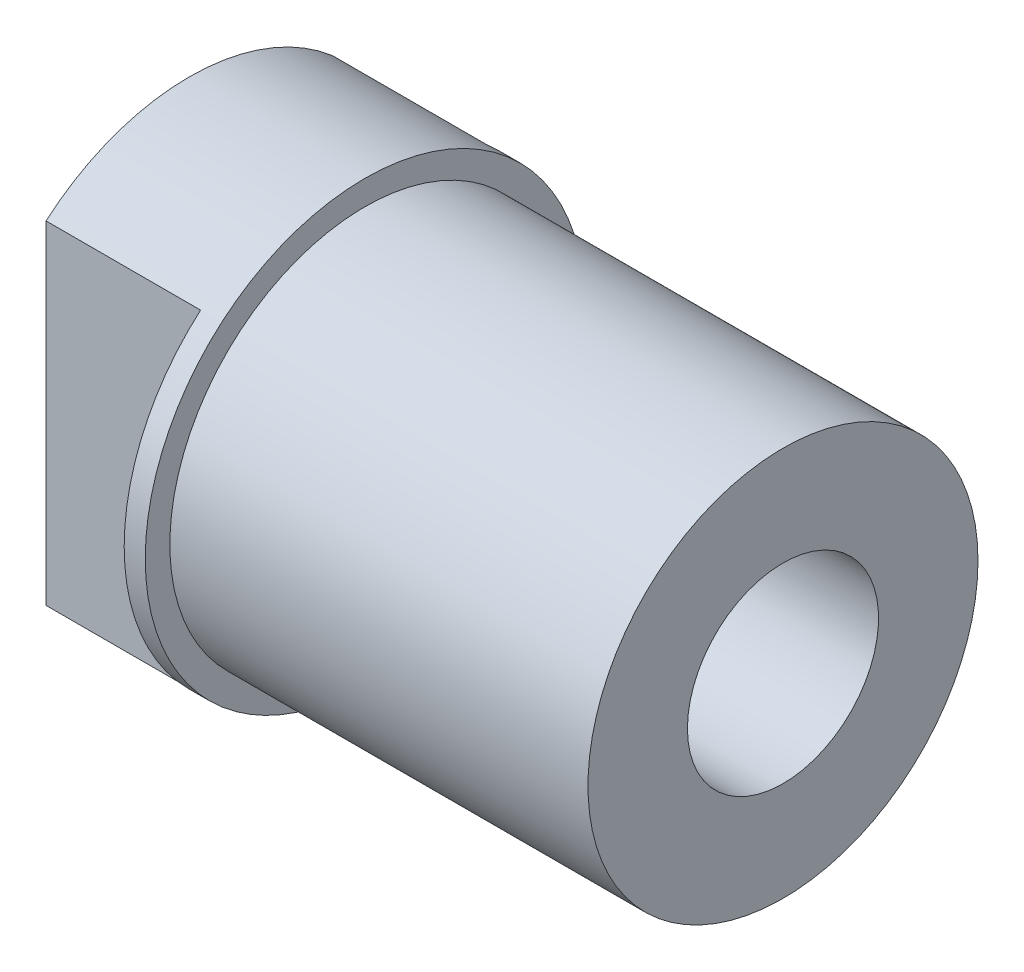
ISO-10303-21;
HEADER;
FILE_DESCRIPTION(('STEP AP214'),'2;1');
FILE_NAME('part.step','',(''),(''),'','','');
FILE_SCHEMA(('AUTOMOTIVE_DESIGN { 1 0 10303 214 1 1 1 1 }'));
ENDSEC;
DATA;
#1=APPLICATION_CONTEXT('core data for automotive mechanical design processes');
#2=APPLICATION_PROTOCOL_DEFINITION('international standard','automotive_design',2000,#1);
#3=PRODUCT_CONTEXT('',#1,'mechanical');
#4=PRODUCT('Part','Part','',(#3));
#5=PRODUCT_RELATED_PRODUCT_CATEGORY('part','',(#4));
#6=PRODUCT_DEFINITION_FORMATION('','',#4);
#7=PRODUCT_DEFINITION_CONTEXT('part definition',#1,'design');
#8=PRODUCT_DEFINITION('design','',#6,#7);
#9=PRODUCT_DEFINITION_SHAPE('','',#8);
#10=(LENGTH_UNIT() NAMED_UNIT(*) SI_UNIT(.MILLI.,.METRE.));
#11=(NAMED_UNIT(*) PLANE_ANGLE_UNIT() SI_UNIT($,.RADIAN.));
#12=(NAMED_UNIT(*) SI_UNIT($,.STERADIAN.) SOLID_ANGLE_UNIT());
#13=UNCERTAINTY_MEASURE_WITH_UNIT(LENGTH_MEASURE(1.E-05),#10,'distance_accuracy_value','');
#14=(GEOMETRIC_REPRESENTATION_CONTEXT(3) GLOBAL_UNCERTAINTY_ASSIGNED_CONTEXT((#13)) GLOBAL_UNIT_ASSIGNED_CONTEXT((#10,
#11,#12)) REPRESENTATION_CONTEXT('',''));
#15=CARTESIAN_POINT('',(0.,0.,0.));
#16=DIRECTION('',(0.,0.,1.));
#17=DIRECTION('',(1.,0.,0.));
#18=AXIS2_PLACEMENT_3D('',#15,#16,#17);
#19=CARTESIAN_POINT('',(-6.35,0.,0.));
#20=DIRECTION('',(1.,0.,0.));
#21=DIRECTION('',(0.,0.,-1.));
#22=AXIS2_PLACEMENT_3D('',#19,#20,#21);
#23=CYLINDRICAL_SURFACE('',#22,7.9375);
#24=DIRECTION('',(1.,0.,0.));
#25=VECTOR('',#24,1.);
#26=CARTESIAN_POINT('',(-6.35,-6.01836304052024,-5.17525));
#27=LINE('',#26,#25);
#28=CARTESIAN_POINT('',(-0.762,-6.01836304052024,-5.17525));
#29=VERTEX_POINT('',#28);
#30=CARTESIAN_POINT('',(-6.35,-6.01836304052024,-5.17525));
#31=VERTEX_POINT('',#30);
#32=EDGE_CURVE('E52',#29,#31,#27,.F.);
#33=ORIENTED_EDGE('',*,*,#32,.F.);
#34=CARTESIAN_POINT('',(-0.762,0.,0.));
#35=DIRECTION('',(1.,0.,0.));
#36=DIRECTION('',(0.,0.,-1.));
#37=AXIS2_PLACEMENT_3D('',#34,#35,#36);
#38=CIRCLE('',#37,7.9375);
#39=CARTESIAN_POINT('',(-0.762,6.01836304052024,-5.17525));
#40=VERTEX_POINT('',#39);
#41=EDGE_CURVE('E11',#40,#29,#38,.F.);
#42=ORIENTED_EDGE('',*,*,#41,.F.);
#43=DIRECTION('',(1.,0.,0.));
#44=VECTOR('',#43,1.);
#45=CARTESIAN_POINT('',(-6.35,6.01836304052024,-5.17525));
#46=LINE('',#45,#44);
#47=CARTESIAN_POINT('',(-6.35,6.01836304052024,-5.17525));
#48=VERTEX_POINT('',#47);
#49=EDGE_CURVE('E102',#48,#40,#46,.T.);
#50=ORIENTED_EDGE('',*,*,#49,.F.);
#51=CARTESIAN_POINT('',(-6.35,0.,0.));
#52=DIRECTION('',(1.,0.,0.));
#53=DIRECTION('',(0.,0.,-1.));
#54=AXIS2_PLACEMENT_3D('',#51,#52,#53);
#55=CIRCLE('',#54,7.9375);
#56=CARTESIAN_POINT('',(-6.35,6.01836304052024,5.17525));
#57=VERTEX_POINT('',#56);
#58=EDGE_CURVE('E112',#48,#57,#55,.T.);
#59=ORIENTED_EDGE('',*,*,#58,.T.);
#60=DIRECTION('',(1.,0.,0.));
#61=VECTOR('',#60,1.);
#62=CARTESIAN_POINT('',(-6.35,6.01836304052024,5.17525));
#63=LINE('',#62,#61);
#64=CARTESIAN_POINT('',(-0.762,6.01836304052024,5.17525));
#65=VERTEX_POINT('',#64);
#66=EDGE_CURVE('E60',#65,#57,#63,.F.);
#67=ORIENTED_EDGE('',*,*,#66,.F.);
#68=CARTESIAN_POINT('',(-0.762,0.,0.));
#69=DIRECTION('',(1.,0.,0.));
#70=DIRECTION('',(0.,0.,-1.));
#71=AXIS2_PLACEMENT_3D('',#68,#69,#70);
#72=CIRCLE('',#71,7.9375);
#73=CARTESIAN_POINT('',(-0.762,-6.01836304052024,5.17525));
#74=VERTEX_POINT('',#73);
#75=EDGE_CURVE('E45',#74,#65,#72,.F.);
#76=ORIENTED_EDGE('',*,*,#75,.F.);
#77=DIRECTION('',(1.,0.,0.));
#78=VECTOR('',#77,1.);
#79=CARTESIAN_POINT('',(-6.35,-6.01836304052024,5.17525));
#80=LINE('',#79,#78);
#81=CARTESIAN_POINT('',(-6.35,-6.01836304052024,5.17525));
#82=VERTEX_POINT('',#81);
#83=EDGE_CURVE('E81',#82,#74,#80,.T.);
#84=ORIENTED_EDGE('',*,*,#83,.F.);
#85=EDGE_CURVE('E113',#82,#31,#55,.T.);
#86=ORIENTED_EDGE('',*,*,#85,.T.);
#87=EDGE_LOOP('',(#33,#42,#50,#59,#67,#76,#84,#86));
#88=FACE_BOUND('',#87,.T.);
#89=CARTESIAN_POINT('',(0.,0.,0.));
#90=DIRECTION('',(1.,0.,0.));
#91=DIRECTION('',(0.,0.,-1.));
#92=AXIS2_PLACEMENT_3D('',#89,#90,#91);
#93=CIRCLE('',#92,7.9375);
#94=CARTESIAN_POINT('',(0.,0.,-7.9375));
#95=VERTEX_POINT('',#94);
#96=EDGE_CURVE('E108',#95,#95,#93,.T.);
#97=ORIENTED_EDGE('',*,*,#96,.F.);
#98=EDGE_LOOP('',(#97));
#99=FACE_BOUND('',#98,.T.);
#100=ADVANCED_FACE('F38',(#88,#99),#23,.T.);
#101=CARTESIAN_POINT('',(-6.35,0.,0.));
#102=DIRECTION('',(1.,0.,0.));
#103=DIRECTION('',(0.,0.,-1.));
#104=AXIS2_PLACEMENT_3D('',#101,#102,#103);
#105=PLANE('',#104);
#106=CARTESIAN_POINT('',(-6.35,0.,0.));
#107=DIRECTION('',(-1.,0.,0.));
#108=DIRECTION('',(0.,0.,1.));
#109=AXIS2_PLACEMENT_3D('',#106,#107,#108);
#110=CIRCLE('',#109,3.4544);
#111=CARTESIAN_POINT('',(-6.35,0.,3.4544));
#112=VERTEX_POINT('',#111);
#113=EDGE_CURVE('E98',#112,#112,#110,.T.);
#114=ORIENTED_EDGE('',*,*,#113,.F.);
#115=EDGE_LOOP('',(#114));
#116=FACE_BOUND('',#115,.T.);
#117=ORIENTED_EDGE('',*,*,#58,.F.);
#118=DIRECTION('',(0.,-1.,0.));
#119=VECTOR('',#118,1.);
#120=CARTESIAN_POINT('',(-6.35,0.,-5.17525));
#121=LINE('',#120,#119);
#122=EDGE_CURVE('E86',#48,#31,#121,.T.);
#123=ORIENTED_EDGE('',*,*,#122,.T.);
#124=ORIENTED_EDGE('',*,*,#85,.F.);
#125=DIRECTION('',(0.,1.,0.));
#126=VECTOR('',#125,1.);
#127=CARTESIAN_POINT('',(-6.35,0.,5.17525));
#128=LINE('',#127,#126);
#129=EDGE_CURVE('E89',#82,#57,#128,.T.);
#130=ORIENTED_EDGE('',*,*,#129,.T.);
#131=EDGE_LOOP('',(#117,#123,#124,#130));
#132=FACE_BOUND('',#131,.T.);
#133=ADVANCED_FACE('F120',(#116,#132),#105,.F.);
#134=CARTESIAN_POINT('',(0.,0.,0.));
#135=DIRECTION('',(1.,0.,0.));
#136=DIRECTION('',(0.,0.,-1.));
#137=AXIS2_PLACEMENT_3D('',#134,#135,#136);
#138=PLANE('',#137);
#139=CARTESIAN_POINT('',(0.,0.,0.));
#140=DIRECTION('',(1.,0.,0.));
#141=DIRECTION('',(0.,0.,-1.));
#142=AXIS2_PLACEMENT_3D('',#139,#140,#141);
#143=CIRCLE('',#142,7.0485);
#144=CARTESIAN_POINT('',(0.,0.,-7.0485));
#145=VERTEX_POINT('',#144);
#146=EDGE_CURVE('E109',#145,#145,#143,.T.);
#147=ORIENTED_EDGE('',*,*,#146,.F.);
#148=EDGE_LOOP('',(#147));
#149=FACE_BOUND('',#148,.T.);
#150=ORIENTED_EDGE('',*,*,#96,.T.);
#151=EDGE_LOOP('',(#150));
#152=FACE_BOUND('',#151,.T.);
#153=ADVANCED_FACE('F141',(#149,#152),#138,.T.);
#154=CARTESIAN_POINT('',(15.113,0.,0.));
#155=DIRECTION('',(-1.,0.,0.));
#156=DIRECTION('',(0.,0.,1.));
#157=AXIS2_PLACEMENT_3D('',#154,#155,#156);
#158=CYLINDRICAL_SURFACE('',#157,7.0485);
#159=CARTESIAN_POINT('',(15.113,0.,0.));
#160=DIRECTION('',(1.,0.,0.));
#161=DIRECTION('',(0.,0.,-1.));
#162=AXIS2_PLACEMENT_3D('',#159,#160,#161);
#163=CIRCLE('',#162,7.0485);
#164=CARTESIAN_POINT('',(15.113,0.,-7.0485));
#165=VERTEX_POINT('',#164);
#166=EDGE_CURVE('E105',#165,#165,#163,.T.);
#167=ORIENTED_EDGE('',*,*,#166,.F.);
#168=EDGE_LOOP('',(#167));
#169=FACE_BOUND('',#168,.T.);
#170=ORIENTED_EDGE('',*,*,#146,.T.);
#171=EDGE_LOOP('',(#170));
#172=FACE_BOUND('',#171,.T.);
#173=ADVANCED_FACE('F147',(#169,#172),#158,.T.);
#174=CARTESIAN_POINT('',(15.113,0.,0.));
#175=DIRECTION('',(1.,0.,0.));
#176=DIRECTION('',(0.,0.,-1.));
#177=AXIS2_PLACEMENT_3D('',#174,#175,#176);
#178=PLANE('',#177);
#179=CARTESIAN_POINT('',(15.113,0.,0.));
#180=DIRECTION('',(-1.,0.,0.));
#181=DIRECTION('',(0.,0.,1.));
#182=AXIS2_PLACEMENT_3D('',#179,#180,#181);
#183=CIRCLE('',#182,3.4544);
#184=CARTESIAN_POINT('',(15.113,0.,3.4544));
#185=VERTEX_POINT('',#184);
#186=EDGE_CURVE('E93',#185,#185,#183,.T.);
#187=ORIENTED_EDGE('',*,*,#186,.T.);
#188=EDGE_LOOP('',(#187));
#189=FACE_BOUND('',#188,.T.);
#190=ORIENTED_EDGE('',*,*,#166,.T.);
#191=EDGE_LOOP('',(#190));
#192=FACE_BOUND('',#191,.T.);
#193=ADVANCED_FACE('F153',(#189,#192),#178,.T.);
#194=CARTESIAN_POINT('',(-6.35,-6.35,5.17525));
#195=DIRECTION('',(0.,0.,-1.));
#196=DIRECTION('',(-1.,0.,0.));
#197=AXIS2_PLACEMENT_3D('',#194,#195,#196);
#198=PLANE('',#197);
#199=ORIENTED_EDGE('',*,*,#66,.T.);
#200=ORIENTED_EDGE('',*,*,#129,.F.);
#201=ORIENTED_EDGE('',*,*,#83,.T.);
#202=DIRECTION('',(0.,1.,0.));
#203=VECTOR('',#202,1.);
#204=CARTESIAN_POINT('',(-0.762,-6.35,5.17525));
#205=LINE('',#204,#203);
#206=EDGE_CURVE('E88',#74,#65,#205,.T.);
#207=ORIENTED_EDGE('',*,*,#206,.T.);
#208=EDGE_LOOP('',(#199,#200,#201,#207));
#209=FACE_BOUND('',#208,.T.);
#210=ADVANCED_FACE('F87',(#209),#198,.F.);
#211=CARTESIAN_POINT('',(-0.762,-6.35,7.9375));
#212=DIRECTION('',(1.,0.,0.));
#213=DIRECTION('',(0.,0.,-1.));
#214=AXIS2_PLACEMENT_3D('',#211,#212,#213);
#215=PLANE('',#214);
#216=ORIENTED_EDGE('',*,*,#206,.F.);
#217=ORIENTED_EDGE('',*,*,#75,.T.);
#218=EDGE_LOOP('',(#216,#217));
#219=FACE_BOUND('',#218,.T.);
#220=ADVANCED_FACE('F92',(#219),#215,.F.);
#221=CARTESIAN_POINT('',(-0.762,-6.35,-7.9375));
#222=DIRECTION('',(1.,0.,0.));
#223=DIRECTION('',(0.,0.,-1.));
#224=AXIS2_PLACEMENT_3D('',#221,#222,#223);
#225=PLANE('',#224);
#226=ORIENTED_EDGE('',*,*,#41,.T.);
#227=DIRECTION('',(0.,1.,0.));
#228=VECTOR('',#227,1.);
#229=CARTESIAN_POINT('',(-0.762,-6.35,-5.17525));
#230=LINE('',#229,#228);
#231=EDGE_CURVE('E90',#29,#40,#230,.T.);
#232=ORIENTED_EDGE('',*,*,#231,.T.);
#233=EDGE_LOOP('',(#226,#232));
#234=FACE_BOUND('',#233,.T.);
#235=ADVANCED_FACE('F124',(#234),#225,.F.);
#236=CARTESIAN_POINT('',(-6.35,-6.35,-5.17525));
#237=DIRECTION('',(0.,0.,1.));
#238=DIRECTION('',(1.,0.,0.));
#239=AXIS2_PLACEMENT_3D('',#236,#237,#238);
#240=PLANE('',#239);
#241=ORIENTED_EDGE('',*,*,#32,.T.);
#242=ORIENTED_EDGE('',*,*,#122,.F.);
#243=ORIENTED_EDGE('',*,*,#49,.T.);
#244=ORIENTED_EDGE('',*,*,#231,.F.);
#245=EDGE_LOOP('',(#241,#242,#243,#244));
#246=FACE_BOUND('',#245,.T.);
#247=ADVANCED_FACE('F125',(#246),#240,.F.);
#248=CARTESIAN_POINT('',(-6.35,0.,0.));
#249=DIRECTION('',(-1.,0.,0.));
#250=DIRECTION('',(0.,0.,1.));
#251=AXIS2_PLACEMENT_3D('',#248,#249,#250);
#252=CYLINDRICAL_SURFACE('',#251,3.4544);
#253=ORIENTED_EDGE('',*,*,#186,.F.);
#254=EDGE_LOOP('',(#253));
#255=FACE_BOUND('',#254,.T.);
#256=ORIENTED_EDGE('',*,*,#113,.T.);
#257=EDGE_LOOP('',(#256));
#258=FACE_BOUND('',#257,.T.);
#259=ADVANCED_FACE('F127',(#255,#258),#252,.F.);
#260=CLOSED_SHELL('',(#100,#133,#153,#173,#193,#210,#220,#235,#247,#259));
#261=MANIFOLD_SOLID_BREP('B2',#260);
#262=ADVANCED_BREP_SHAPE_REPRESENTATION('',(#18,#261),#14);
#263=SHAPE_DEFINITION_REPRESENTATION(#9,#262);
ENDSEC;
END-ISO-10303-21;
